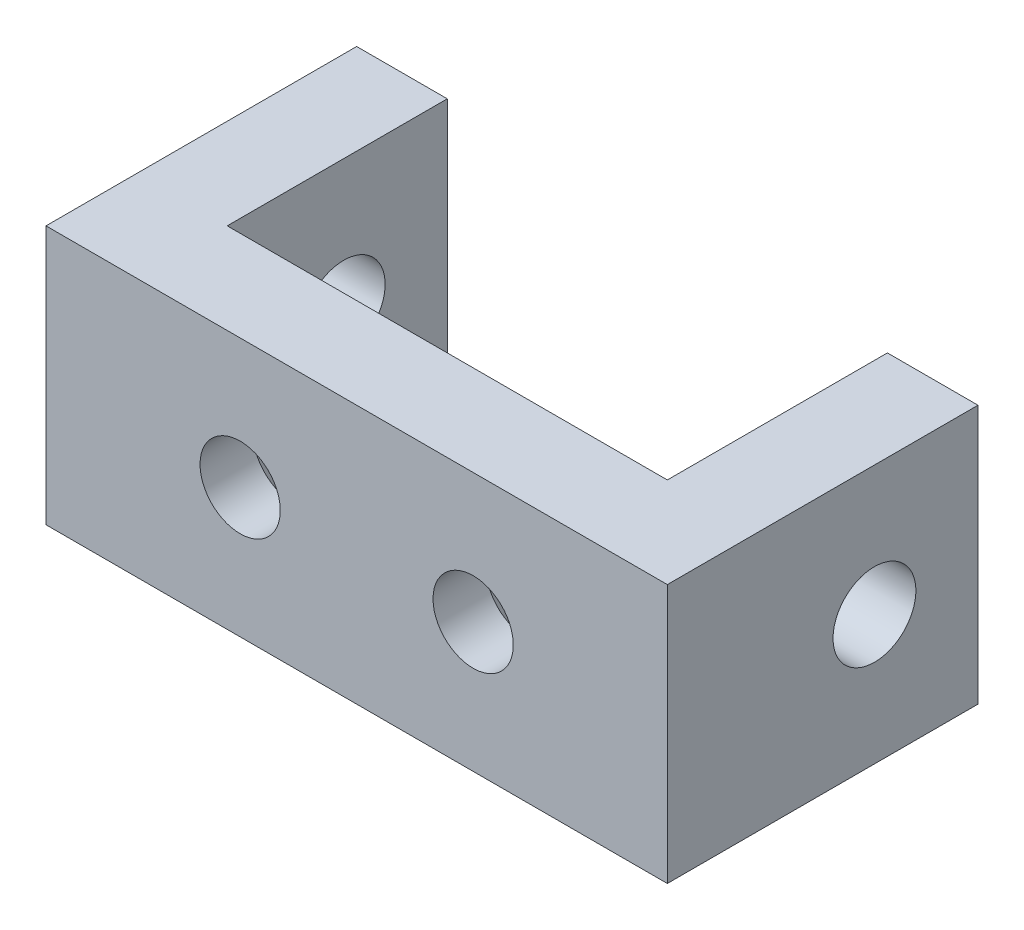
ISO-10303-21;
HEADER;
FILE_DESCRIPTION(('STEP AP214'),'2;1');
FILE_NAME('part.step','',(''),(''),'','','');
FILE_SCHEMA(('AUTOMOTIVE_DESIGN { 1 0 10303 214 1 1 1 1 }'));
ENDSEC;
DATA;
#1=APPLICATION_CONTEXT('core data for automotive mechanical design processes');
#2=APPLICATION_PROTOCOL_DEFINITION('international standard','automotive_design',2000,#1);
#3=PRODUCT_CONTEXT('',#1,'mechanical');
#4=PRODUCT('Part','Part','',(#3));
#5=PRODUCT_RELATED_PRODUCT_CATEGORY('part','',(#4));
#6=PRODUCT_DEFINITION_FORMATION('','',#4);
#7=PRODUCT_DEFINITION_CONTEXT('part definition',#1,'design');
#8=PRODUCT_DEFINITION('design','',#6,#7);
#9=PRODUCT_DEFINITION_SHAPE('','',#8);
#10=(LENGTH_UNIT() NAMED_UNIT(*) SI_UNIT(.MILLI.,.METRE.));
#11=(NAMED_UNIT(*) PLANE_ANGLE_UNIT() SI_UNIT($,.RADIAN.));
#12=(NAMED_UNIT(*) SI_UNIT($,.STERADIAN.) SOLID_ANGLE_UNIT());
#13=UNCERTAINTY_MEASURE_WITH_UNIT(LENGTH_MEASURE(1.E-05),#10,'distance_accuracy_value','');
#14=(GEOMETRIC_REPRESENTATION_CONTEXT(3) GLOBAL_UNCERTAINTY_ASSIGNED_CONTEXT((#13)) GLOBAL_UNIT_ASSIGNED_CONTEXT((#10,
#11,#12)) REPRESENTATION_CONTEXT('',''));
#15=CARTESIAN_POINT('',(0.,0.,0.));
#16=DIRECTION('',(0.,0.,1.));
#17=DIRECTION('',(1.,0.,0.));
#18=AXIS2_PLACEMENT_3D('',#15,#16,#17);
#19=CARTESIAN_POINT('',(-12.,10.,0.));
#20=DIRECTION('',(-1.,0.,0.));
#21=DIRECTION('',(0.,0.,1.));
#22=AXIS2_PLACEMENT_3D('',#19,#20,#21);
#23=PLANE('',#22);
#24=CARTESIAN_POINT('',(-12.,5.,-6.25));
#25=DIRECTION('',(-1.,0.,0.));
#26=DIRECTION('',(0.,0.,1.));
#27=AXIS2_PLACEMENT_3D('',#24,#25,#26);
#28=CIRCLE('',#27,1.6);
#29=CARTESIAN_POINT('',(-12.,5.,-4.65));
#30=VERTEX_POINT('',#29);
#31=EDGE_CURVE('E205',#30,#30,#28,.T.);
#32=ORIENTED_EDGE('',*,*,#31,.F.);
#33=EDGE_LOOP('',(#32));
#34=FACE_BOUND('',#33,.T.);
#35=DIRECTION('',(0.,0.,-1.));
#36=VECTOR('',#35,1.);
#37=CARTESIAN_POINT('',(-12.,0.,0.));
#38=LINE('',#37,#36);
#39=CARTESIAN_POINT('',(-12.,0.,1.75));
#40=VERTEX_POINT('',#39);
#41=CARTESIAN_POINT('',(-12.,0.,-10.25));
#42=VERTEX_POINT('',#41);
#43=EDGE_CURVE('E129',#40,#42,#38,.T.);
#44=ORIENTED_EDGE('',*,*,#43,.F.);
#45=DIRECTION('',(0.,-1.,0.));
#46=VECTOR('',#45,1.);
#47=CARTESIAN_POINT('',(-12.,10.,1.75));
#48=LINE('',#47,#46);
#49=CARTESIAN_POINT('',(-12.,10.,1.75));
#50=VERTEX_POINT('',#49);
#51=EDGE_CURVE('E11',#50,#40,#48,.T.);
#52=ORIENTED_EDGE('',*,*,#51,.F.);
#53=DIRECTION('',(0.,0.,-1.));
#54=VECTOR('',#53,1.);
#55=CARTESIAN_POINT('',(-12.,10.,0.));
#56=LINE('',#55,#54);
#57=CARTESIAN_POINT('',(-12.,10.,-10.25));
#58=VERTEX_POINT('',#57);
#59=EDGE_CURVE('E149',#50,#58,#56,.T.);
#60=ORIENTED_EDGE('',*,*,#59,.T.);
#61=DIRECTION('',(0.,-1.,0.));
#62=VECTOR('',#61,1.);
#63=CARTESIAN_POINT('',(-12.,10.,-10.25));
#64=LINE('',#63,#62);
#65=EDGE_CURVE('E85',#58,#42,#64,.T.);
#66=ORIENTED_EDGE('',*,*,#65,.T.);
#67=EDGE_LOOP('',(#44,#52,#60,#66));
#68=FACE_BOUND('',#67,.T.);
#69=ADVANCED_FACE('F34',(#34,#68),#23,.T.);
#70=CARTESIAN_POINT('',(0.,10.,1.75));
#71=DIRECTION('',(0.,0.,1.));
#72=DIRECTION('',(1.,0.,0.));
#73=AXIS2_PLACEMENT_3D('',#70,#71,#72);
#74=PLANE('',#73);
#75=CARTESIAN_POINT('',(4.5,5.,1.75));
#76=DIRECTION('',(0.,0.,-1.));
#77=DIRECTION('',(-1.,0.,0.));
#78=AXIS2_PLACEMENT_3D('',#75,#76,#77);
#79=CIRCLE('',#78,1.55);
#80=CARTESIAN_POINT('',(2.95,5.,1.75));
#81=VERTEX_POINT('',#80);
#82=EDGE_CURVE('E331',#81,#81,#79,.T.);
#83=ORIENTED_EDGE('',*,*,#82,.T.);
#84=EDGE_LOOP('',(#83));
#85=FACE_BOUND('',#84,.T.);
#86=CARTESIAN_POINT('',(-4.5,5.,1.75));
#87=DIRECTION('',(0.,0.,-1.));
#88=DIRECTION('',(-1.,0.,0.));
#89=AXIS2_PLACEMENT_3D('',#86,#87,#88);
#90=CIRCLE('',#89,1.55);
#91=CARTESIAN_POINT('',(-6.05,5.,1.75));
#92=VERTEX_POINT('',#91);
#93=EDGE_CURVE('E207',#92,#92,#90,.T.);
#94=ORIENTED_EDGE('',*,*,#93,.T.);
#95=EDGE_LOOP('',(#94));
#96=FACE_BOUND('',#95,.T.);
#97=DIRECTION('',(-1.,0.,0.));
#98=VECTOR('',#97,1.);
#99=CARTESIAN_POINT('',(0.,0.,1.75));
#100=LINE('',#99,#98);
#101=CARTESIAN_POINT('',(12.,0.,1.75));
#102=VERTEX_POINT('',#101);
#103=EDGE_CURVE('E132',#102,#40,#100,.T.);
#104=ORIENTED_EDGE('',*,*,#103,.F.);
#105=DIRECTION('',(0.,-1.,0.));
#106=VECTOR('',#105,1.);
#107=CARTESIAN_POINT('',(12.,10.,1.75));
#108=LINE('',#107,#106);
#109=CARTESIAN_POINT('',(12.,10.,1.75));
#110=VERTEX_POINT('',#109);
#111=EDGE_CURVE('E43',#110,#102,#108,.T.);
#112=ORIENTED_EDGE('',*,*,#111,.F.);
#113=DIRECTION('',(-1.,0.,0.));
#114=VECTOR('',#113,1.);
#115=CARTESIAN_POINT('',(0.,10.,1.75));
#116=LINE('',#115,#114);
#117=EDGE_CURVE('E171',#110,#50,#116,.T.);
#118=ORIENTED_EDGE('',*,*,#117,.T.);
#119=ORIENTED_EDGE('',*,*,#51,.T.);
#120=EDGE_LOOP('',(#104,#112,#118,#119));
#121=FACE_BOUND('',#120,.T.);
#122=ADVANCED_FACE('F170',(#85,#96,#121),#74,.T.);
#123=CARTESIAN_POINT('',(12.,10.,0.));
#124=DIRECTION('',(-1.,0.,0.));
#125=DIRECTION('',(0.,0.,1.));
#126=AXIS2_PLACEMENT_3D('',#123,#124,#125);
#127=PLANE('',#126);
#128=CARTESIAN_POINT('',(12.,5.,-6.25));
#129=DIRECTION('',(-1.,0.,0.));
#130=DIRECTION('',(0.,0.,1.));
#131=AXIS2_PLACEMENT_3D('',#128,#129,#130);
#132=CIRCLE('',#131,1.6);
#133=CARTESIAN_POINT('',(12.,5.,-4.65));
#134=VERTEX_POINT('',#133);
#135=EDGE_CURVE('E133',#134,#134,#132,.T.);
#136=ORIENTED_EDGE('',*,*,#135,.T.);
#137=EDGE_LOOP('',(#136));
#138=FACE_BOUND('',#137,.T.);
#139=DIRECTION('',(0.,0.,-1.));
#140=VECTOR('',#139,1.);
#141=CARTESIAN_POINT('',(12.,0.,0.));
#142=LINE('',#141,#140);
#143=CARTESIAN_POINT('',(12.,0.,-10.25));
#144=VERTEX_POINT('',#143);
#145=EDGE_CURVE('E136',#102,#144,#142,.T.);
#146=ORIENTED_EDGE('',*,*,#145,.T.);
#147=DIRECTION('',(0.,-1.,0.));
#148=VECTOR('',#147,1.);
#149=CARTESIAN_POINT('',(12.,10.,-10.25));
#150=LINE('',#149,#148);
#151=CARTESIAN_POINT('',(12.,10.,-10.25));
#152=VERTEX_POINT('',#151);
#153=EDGE_CURVE('E155',#152,#144,#150,.T.);
#154=ORIENTED_EDGE('',*,*,#153,.F.);
#155=DIRECTION('',(0.,0.,-1.));
#156=VECTOR('',#155,1.);
#157=CARTESIAN_POINT('',(12.,10.,0.));
#158=LINE('',#157,#156);
#159=EDGE_CURVE('E162',#110,#152,#158,.T.);
#160=ORIENTED_EDGE('',*,*,#159,.F.);
#161=ORIENTED_EDGE('',*,*,#111,.T.);
#162=EDGE_LOOP('',(#146,#154,#160,#161));
#163=FACE_BOUND('',#162,.T.);
#164=ADVANCED_FACE('F160',(#138,#163),#127,.F.);
#165=CARTESIAN_POINT('',(0.,10.,-10.25));
#166=DIRECTION('',(0.,0.,-1.));
#167=DIRECTION('',(-1.,0.,0.));
#168=AXIS2_PLACEMENT_3D('',#165,#166,#167);
#169=PLANE('',#168);
#170=DIRECTION('',(1.,0.,0.));
#171=VECTOR('',#170,1.);
#172=CARTESIAN_POINT('',(0.,0.,-10.25));
#173=LINE('',#172,#171);
#174=CARTESIAN_POINT('',(8.5,0.,-10.25));
#175=VERTEX_POINT('',#174);
#176=EDGE_CURVE('E139',#175,#144,#173,.T.);
#177=ORIENTED_EDGE('',*,*,#176,.F.);
#178=DIRECTION('',(0.,-1.,0.));
#179=VECTOR('',#178,1.);
#180=CARTESIAN_POINT('',(8.5,10.,-10.25));
#181=LINE('',#180,#179);
#182=CARTESIAN_POINT('',(8.5,10.,-10.25));
#183=VERTEX_POINT('',#182);
#184=EDGE_CURVE('E153',#183,#175,#181,.T.);
#185=ORIENTED_EDGE('',*,*,#184,.F.);
#186=DIRECTION('',(1.,0.,0.));
#187=VECTOR('',#186,1.);
#188=CARTESIAN_POINT('',(0.,10.,-10.25));
#189=LINE('',#188,#187);
#190=EDGE_CURVE('E124',#183,#152,#189,.T.);
#191=ORIENTED_EDGE('',*,*,#190,.T.);
#192=ORIENTED_EDGE('',*,*,#153,.T.);
#193=EDGE_LOOP('',(#177,#185,#191,#192));
#194=FACE_BOUND('',#193,.T.);
#195=ADVANCED_FACE('F182',(#194),#169,.T.);
#196=CARTESIAN_POINT('',(8.5,10.,0.));
#197=DIRECTION('',(-1.,0.,0.));
#198=DIRECTION('',(0.,0.,1.));
#199=AXIS2_PLACEMENT_3D('',#196,#197,#198);
#200=PLANE('',#199);
#201=CARTESIAN_POINT('',(8.5,5.,-6.25));
#202=DIRECTION('',(-1.,0.,0.));
#203=DIRECTION('',(0.,0.,1.));
#204=AXIS2_PLACEMENT_3D('',#201,#202,#203);
#205=CIRCLE('',#204,1.6);
#206=CARTESIAN_POINT('',(8.5,5.,-4.65));
#207=VERTEX_POINT('',#206);
#208=EDGE_CURVE('E210',#207,#207,#205,.T.);
#209=ORIENTED_EDGE('',*,*,#208,.F.);
#210=EDGE_LOOP('',(#209));
#211=FACE_BOUND('',#210,.T.);
#212=DIRECTION('',(0.,0.,-1.));
#213=VECTOR('',#212,1.);
#214=CARTESIAN_POINT('',(8.5,0.,0.));
#215=LINE('',#214,#213);
#216=CARTESIAN_POINT('',(8.5,0.,-1.75));
#217=VERTEX_POINT('',#216);
#218=EDGE_CURVE('E142',#217,#175,#215,.T.);
#219=ORIENTED_EDGE('',*,*,#218,.F.);
#220=DIRECTION('',(0.,-1.,0.));
#221=VECTOR('',#220,1.);
#222=CARTESIAN_POINT('',(8.5,10.,-1.75));
#223=LINE('',#222,#221);
#224=CARTESIAN_POINT('',(8.5,10.,-1.75));
#225=VERTEX_POINT('',#224);
#226=EDGE_CURVE('E112',#225,#217,#223,.T.);
#227=ORIENTED_EDGE('',*,*,#226,.F.);
#228=DIRECTION('',(0.,0.,-1.));
#229=VECTOR('',#228,1.);
#230=CARTESIAN_POINT('',(8.5,10.,0.));
#231=LINE('',#230,#229);
#232=EDGE_CURVE('E122',#225,#183,#231,.T.);
#233=ORIENTED_EDGE('',*,*,#232,.T.);
#234=ORIENTED_EDGE('',*,*,#184,.T.);
#235=EDGE_LOOP('',(#219,#227,#233,#234));
#236=FACE_BOUND('',#235,.T.);
#237=ADVANCED_FACE('F185',(#211,#236),#200,.T.);
#238=CARTESIAN_POINT('',(0.,10.,-1.75));
#239=DIRECTION('',(0.,0.,-1.));
#240=DIRECTION('',(-1.,0.,0.));
#241=AXIS2_PLACEMENT_3D('',#238,#239,#240);
#242=PLANE('',#241);
#243=CARTESIAN_POINT('',(4.5,5.,-1.75));
#244=DIRECTION('',(0.,0.,-1.));
#245=DIRECTION('',(-1.,0.,0.));
#246=AXIS2_PLACEMENT_3D('',#243,#244,#245);
#247=CIRCLE('',#246,3.);
#248=CARTESIAN_POINT('',(1.5,5.,-1.75));
#249=VERTEX_POINT('',#248);
#250=EDGE_CURVE('E329',#249,#249,#247,.T.);
#251=ORIENTED_EDGE('',*,*,#250,.F.);
#252=EDGE_LOOP('',(#251));
#253=FACE_BOUND('',#252,.T.);
#254=CARTESIAN_POINT('',(-4.5,5.,-1.75));
#255=DIRECTION('',(0.,0.,-1.));
#256=DIRECTION('',(-1.,0.,0.));
#257=AXIS2_PLACEMENT_3D('',#254,#255,#256);
#258=CIRCLE('',#257,3.);
#259=CARTESIAN_POINT('',(-7.5,5.,-1.75));
#260=VERTEX_POINT('',#259);
#261=EDGE_CURVE('E336',#260,#260,#258,.T.);
#262=ORIENTED_EDGE('',*,*,#261,.F.);
#263=EDGE_LOOP('',(#262));
#264=FACE_BOUND('',#263,.T.);
#265=DIRECTION('',(1.,0.,0.));
#266=VECTOR('',#265,1.);
#267=CARTESIAN_POINT('',(0.,0.,-1.75));
#268=LINE('',#267,#266);
#269=CARTESIAN_POINT('',(-8.5,0.,-1.75));
#270=VERTEX_POINT('',#269);
#271=EDGE_CURVE('E111',#270,#217,#268,.T.);
#272=ORIENTED_EDGE('',*,*,#271,.F.);
#273=DIRECTION('',(0.,-1.,0.));
#274=VECTOR('',#273,1.);
#275=CARTESIAN_POINT('',(-8.5,10.,-1.75));
#276=LINE('',#275,#274);
#277=CARTESIAN_POINT('',(-8.5,10.,-1.75));
#278=VERTEX_POINT('',#277);
#279=EDGE_CURVE('E105',#278,#270,#276,.T.);
#280=ORIENTED_EDGE('',*,*,#279,.F.);
#281=DIRECTION('',(1.,0.,0.));
#282=VECTOR('',#281,1.);
#283=CARTESIAN_POINT('',(0.,10.,-1.75));
#284=LINE('',#283,#282);
#285=EDGE_CURVE('E109',#278,#225,#284,.T.);
#286=ORIENTED_EDGE('',*,*,#285,.T.);
#287=ORIENTED_EDGE('',*,*,#226,.T.);
#288=EDGE_LOOP('',(#272,#280,#286,#287));
#289=FACE_BOUND('',#288,.T.);
#290=ADVANCED_FACE('F107',(#253,#264,#289),#242,.T.);
#291=CARTESIAN_POINT('',(-8.5,10.,0.));
#292=DIRECTION('',(-1.,0.,0.));
#293=DIRECTION('',(0.,0.,1.));
#294=AXIS2_PLACEMENT_3D('',#291,#292,#293);
#295=PLANE('',#294);
#296=CARTESIAN_POINT('',(-8.5,5.,-6.25));
#297=DIRECTION('',(-1.,0.,0.));
#298=DIRECTION('',(0.,0.,1.));
#299=AXIS2_PLACEMENT_3D('',#296,#297,#298);
#300=CIRCLE('',#299,1.6);
#301=CARTESIAN_POINT('',(-8.5,5.,-4.65));
#302=VERTEX_POINT('',#301);
#303=EDGE_CURVE('E37',#302,#302,#300,.T.);
#304=ORIENTED_EDGE('',*,*,#303,.T.);
#305=EDGE_LOOP('',(#304));
#306=FACE_BOUND('',#305,.T.);
#307=DIRECTION('',(0.,0.,-1.));
#308=VECTOR('',#307,1.);
#309=CARTESIAN_POINT('',(-8.5,0.,0.));
#310=LINE('',#309,#308);
#311=CARTESIAN_POINT('',(-8.5,0.,-10.25));
#312=VERTEX_POINT('',#311);
#313=EDGE_CURVE('E78',#270,#312,#310,.T.);
#314=ORIENTED_EDGE('',*,*,#313,.T.);
#315=DIRECTION('',(0.,-1.,0.));
#316=VECTOR('',#315,1.);
#317=CARTESIAN_POINT('',(-8.5,10.,-10.25));
#318=LINE('',#317,#316);
#319=CARTESIAN_POINT('',(-8.5,10.,-10.25));
#320=VERTEX_POINT('',#319);
#321=EDGE_CURVE('E113',#320,#312,#318,.T.);
#322=ORIENTED_EDGE('',*,*,#321,.F.);
#323=DIRECTION('',(0.,0.,-1.));
#324=VECTOR('',#323,1.);
#325=CARTESIAN_POINT('',(-8.5,10.,0.));
#326=LINE('',#325,#324);
#327=EDGE_CURVE('E115',#278,#320,#326,.T.);
#328=ORIENTED_EDGE('',*,*,#327,.F.);
#329=ORIENTED_EDGE('',*,*,#279,.T.);
#330=EDGE_LOOP('',(#314,#322,#328,#329));
#331=FACE_BOUND('',#330,.T.);
#332=ADVANCED_FACE('F116',(#306,#331),#295,.F.);
#333=CARTESIAN_POINT('',(0.,10.,-10.25));
#334=DIRECTION('',(0.,0.,1.));
#335=DIRECTION('',(1.,0.,0.));
#336=AXIS2_PLACEMENT_3D('',#333,#334,#335);
#337=PLANE('',#336);
#338=DIRECTION('',(-1.,0.,0.));
#339=VECTOR('',#338,1.);
#340=CARTESIAN_POINT('',(0.,0.,-10.25));
#341=LINE('',#340,#339);
#342=EDGE_CURVE('E147',#312,#42,#341,.T.);
#343=ORIENTED_EDGE('',*,*,#342,.T.);
#344=ORIENTED_EDGE('',*,*,#65,.F.);
#345=DIRECTION('',(-1.,0.,0.));
#346=VECTOR('',#345,1.);
#347=CARTESIAN_POINT('',(0.,10.,-10.25));
#348=LINE('',#347,#346);
#349=EDGE_CURVE('E51',#320,#58,#348,.T.);
#350=ORIENTED_EDGE('',*,*,#349,.F.);
#351=ORIENTED_EDGE('',*,*,#321,.T.);
#352=EDGE_LOOP('',(#343,#344,#350,#351));
#353=FACE_BOUND('',#352,.T.);
#354=ADVANCED_FACE('F174',(#353),#337,.F.);
#355=CARTESIAN_POINT('',(0.,10.,0.));
#356=DIRECTION('',(0.,1.,0.));
#357=DIRECTION('',(0.,0.,1.));
#358=AXIS2_PLACEMENT_3D('',#355,#356,#357);
#359=PLANE('',#358);
#360=ORIENTED_EDGE('',*,*,#59,.F.);
#361=ORIENTED_EDGE('',*,*,#117,.F.);
#362=ORIENTED_EDGE('',*,*,#159,.T.);
#363=ORIENTED_EDGE('',*,*,#190,.F.);
#364=ORIENTED_EDGE('',*,*,#232,.F.);
#365=ORIENTED_EDGE('',*,*,#285,.F.);
#366=ORIENTED_EDGE('',*,*,#327,.T.);
#367=ORIENTED_EDGE('',*,*,#349,.T.);
#368=EDGE_LOOP('',(#360,#361,#362,#363,#364,#365,#366,#367));
#369=FACE_BOUND('',#368,.T.);
#370=ADVANCED_FACE('F119',(#369),#359,.T.);
#371=CARTESIAN_POINT('',(0.,0.,0.));
#372=DIRECTION('',(0.,1.,0.));
#373=DIRECTION('',(0.,0.,1.));
#374=AXIS2_PLACEMENT_3D('',#371,#372,#373);
#375=PLANE('',#374);
#376=ORIENTED_EDGE('',*,*,#43,.T.);
#377=ORIENTED_EDGE('',*,*,#342,.F.);
#378=ORIENTED_EDGE('',*,*,#313,.F.);
#379=ORIENTED_EDGE('',*,*,#271,.T.);
#380=ORIENTED_EDGE('',*,*,#218,.T.);
#381=ORIENTED_EDGE('',*,*,#176,.T.);
#382=ORIENTED_EDGE('',*,*,#145,.F.);
#383=ORIENTED_EDGE('',*,*,#103,.T.);
#384=EDGE_LOOP('',(#376,#377,#378,#379,#380,#381,#382,#383));
#385=FACE_BOUND('',#384,.T.);
#386=ADVANCED_FACE('F168',(#385),#375,.F.);
#387=CARTESIAN_POINT('',(12.5,5.,-6.25));
#388=DIRECTION('',(-1.,0.,0.));
#389=DIRECTION('',(0.,0.,1.));
#390=AXIS2_PLACEMENT_3D('',#387,#388,#389);
#391=CYLINDRICAL_SURFACE('',#390,1.6);
#392=ORIENTED_EDGE('',*,*,#31,.T.);
#393=EDGE_LOOP('',(#392));
#394=FACE_BOUND('',#393,.T.);
#395=ORIENTED_EDGE('',*,*,#303,.F.);
#396=EDGE_LOOP('',(#395));
#397=FACE_BOUND('',#396,.T.);
#398=ADVANCED_FACE('F224',(#394,#397),#391,.F.);
#399=ORIENTED_EDGE('',*,*,#208,.T.);
#400=EDGE_LOOP('',(#399));
#401=FACE_BOUND('',#400,.T.);
#402=ORIENTED_EDGE('',*,*,#135,.F.);
#403=EDGE_LOOP('',(#402));
#404=FACE_BOUND('',#403,.T.);
#405=ADVANCED_FACE('F221',(#401,#404),#391,.F.);
#406=CARTESIAN_POINT('',(-4.5,5.,-1.75));
#407=DIRECTION('',(0.,0.,-1.));
#408=DIRECTION('',(-1.,0.,0.));
#409=AXIS2_PLACEMENT_3D('',#406,#407,#408);
#410=CYLINDRICAL_SURFACE('',#409,1.55);
#411=ORIENTED_EDGE('',*,*,#93,.F.);
#412=EDGE_LOOP('',(#411));
#413=FACE_BOUND('',#412,.T.);
#414=CARTESIAN_POINT('',(-4.5,5.,-0.300000000000001));
#415=DIRECTION('',(0.,0.,-1.));
#416=DIRECTION('',(-1.,0.,0.));
#417=AXIS2_PLACEMENT_3D('',#414,#415,#416);
#418=CIRCLE('',#417,1.55);
#419=CARTESIAN_POINT('',(-6.05,5.,-0.300000000000001));
#420=VERTEX_POINT('',#419);
#421=EDGE_CURVE('E212',#420,#420,#418,.T.);
#422=ORIENTED_EDGE('',*,*,#421,.T.);
#423=EDGE_LOOP('',(#422));
#424=FACE_BOUND('',#423,.T.);
#425=ADVANCED_FACE('F223',(#413,#424),#410,.F.);
#426=CARTESIAN_POINT('',(-4.5,5.,-1.75));
#427=DIRECTION('',(0.,0.,-1.));
#428=DIRECTION('',(-1.,0.,0.));
#429=AXIS2_PLACEMENT_3D('',#426,#427,#428);
#430=CONICAL_SURFACE('',#429,3.,0.785398163397449);
#431=ORIENTED_EDGE('',*,*,#421,.F.);
#432=EDGE_LOOP('',(#431));
#433=FACE_BOUND('',#432,.T.);
#434=ORIENTED_EDGE('',*,*,#261,.T.);
#435=EDGE_LOOP('',(#434));
#436=FACE_BOUND('',#435,.T.);
#437=ADVANCED_FACE('F230',(#433,#436),#430,.F.);
#438=CARTESIAN_POINT('',(4.5,5.,-1.75));
#439=DIRECTION('',(0.,0.,-1.));
#440=DIRECTION('',(-1.,0.,0.));
#441=AXIS2_PLACEMENT_3D('',#438,#439,#440);
#442=CYLINDRICAL_SURFACE('',#441,1.55);
#443=ORIENTED_EDGE('',*,*,#82,.F.);
#444=EDGE_LOOP('',(#443));
#445=FACE_BOUND('',#444,.T.);
#446=CARTESIAN_POINT('',(4.5,5.,-0.300000000000002));
#447=DIRECTION('',(0.,0.,-1.));
#448=DIRECTION('',(-1.,0.,0.));
#449=AXIS2_PLACEMENT_3D('',#446,#447,#448);
#450=CIRCLE('',#449,1.55);
#451=CARTESIAN_POINT('',(2.95,5.,-0.300000000000002));
#452=VERTEX_POINT('',#451);
#453=EDGE_CURVE('E326',#452,#452,#450,.T.);
#454=ORIENTED_EDGE('',*,*,#453,.T.);
#455=EDGE_LOOP('',(#454));
#456=FACE_BOUND('',#455,.T.);
#457=ADVANCED_FACE('F300',(#445,#456),#442,.F.);
#458=CARTESIAN_POINT('',(4.5,5.,-1.75));
#459=DIRECTION('',(0.,0.,-1.));
#460=DIRECTION('',(-1.,0.,0.));
#461=AXIS2_PLACEMENT_3D('',#458,#459,#460);
#462=CONICAL_SURFACE('',#461,3.,0.785398163397449);
#463=ORIENTED_EDGE('',*,*,#453,.F.);
#464=EDGE_LOOP('',(#463));
#465=FACE_BOUND('',#464,.T.);
#466=ORIENTED_EDGE('',*,*,#250,.T.);
#467=EDGE_LOOP('',(#466));
#468=FACE_BOUND('',#467,.T.);
#469=ADVANCED_FACE('F309',(#465,#468),#462,.F.);
#470=CLOSED_SHELL('',(#69,#122,#164,#195,#237,#290,#332,#354,#370,#386,#398,#405,#425,#437,#457,#469));
#471=MANIFOLD_SOLID_BREP('B2',#470);
#472=ADVANCED_BREP_SHAPE_REPRESENTATION('',(#18,#471),#14);
#473=SHAPE_DEFINITION_REPRESENTATION(#9,#472);
ENDSEC;
END-ISO-10303-21;
